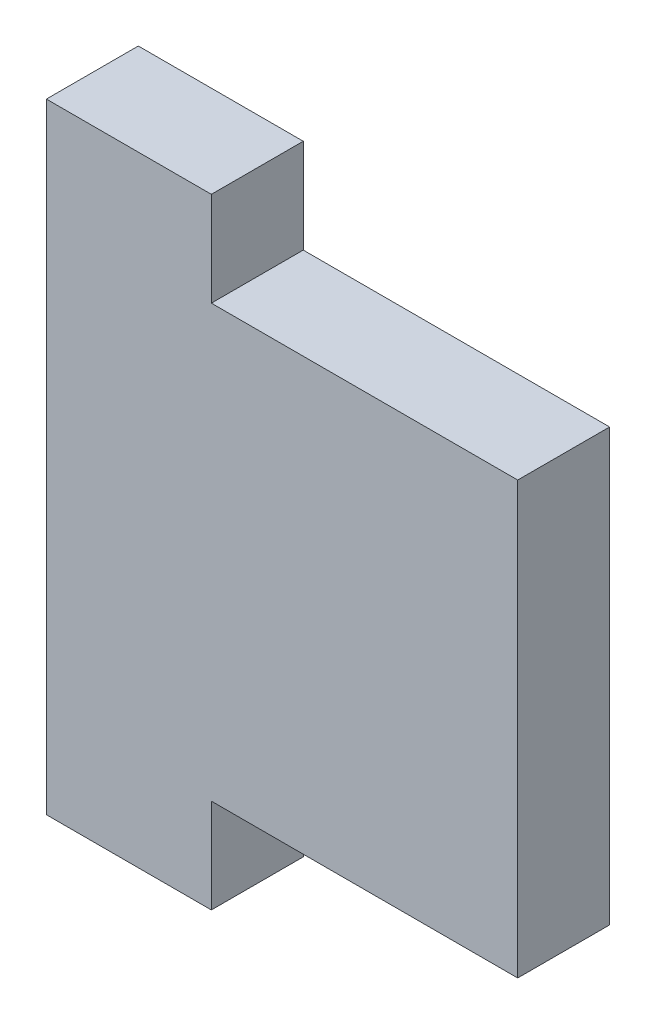
ISO-10303-21;
HEADER;
FILE_DESCRIPTION(('STEP AP214'),'2;1');
FILE_NAME('part.step','',(''),(''),'','','');
FILE_SCHEMA(('AUTOMOTIVE_DESIGN { 1 0 10303 214 1 1 1 1 }'));
ENDSEC;
DATA;
#1=APPLICATION_CONTEXT('core data for automotive mechanical design processes');
#2=APPLICATION_PROTOCOL_DEFINITION('international standard','automotive_design',2000,#1);
#3=PRODUCT_CONTEXT('',#1,'mechanical');
#4=PRODUCT('Part','Part','',(#3));
#5=PRODUCT_RELATED_PRODUCT_CATEGORY('part','',(#4));
#6=PRODUCT_DEFINITION_FORMATION('','',#4);
#7=PRODUCT_DEFINITION_CONTEXT('part definition',#1,'design');
#8=PRODUCT_DEFINITION('design','',#6,#7);
#9=PRODUCT_DEFINITION_SHAPE('','',#8);
#10=(LENGTH_UNIT() NAMED_UNIT(*) SI_UNIT(.MILLI.,.METRE.));
#11=(NAMED_UNIT(*) PLANE_ANGLE_UNIT() SI_UNIT($,.RADIAN.));
#12=(NAMED_UNIT(*) SI_UNIT($,.STERADIAN.) SOLID_ANGLE_UNIT());
#13=UNCERTAINTY_MEASURE_WITH_UNIT(LENGTH_MEASURE(1.E-05),#10,'distance_accuracy_value','');
#14=(GEOMETRIC_REPRESENTATION_CONTEXT(3) GLOBAL_UNCERTAINTY_ASSIGNED_CONTEXT((#13)) GLOBAL_UNIT_ASSIGNED_CONTEXT((#10,
#11,#12)) REPRESENTATION_CONTEXT('',''));
#15=CARTESIAN_POINT('',(0.,0.,0.));
#16=DIRECTION('',(0.,0.,1.));
#17=DIRECTION('',(1.,0.,0.));
#18=AXIS2_PLACEMENT_3D('',#15,#16,#17);
#19=CARTESIAN_POINT('',(-54.483,11.6205,2.4765));
#20=DIRECTION('',(-1.,0.,0.));
#21=DIRECTION('',(0.,0.,1.));
#22=AXIS2_PLACEMENT_3D('',#19,#20,#21);
#23=PLANE('',#22);
#24=DIRECTION('',(0.,1.,0.));
#25=VECTOR('',#24,1.);
#26=CARTESIAN_POINT('',(-54.483,11.6205,-2.4765));
#27=LINE('',#26,#25);
#28=CARTESIAN_POINT('',(-54.483,-11.6205,-2.4765));
#29=VERTEX_POINT('',#28);
#30=CARTESIAN_POINT('',(-54.483,11.6205,-2.4765));
#31=VERTEX_POINT('',#30);
#32=EDGE_CURVE('E129',#29,#31,#27,.T.);
#33=ORIENTED_EDGE('',*,*,#32,.T.);
#34=DIRECTION('',(0.,0.,-1.));
#35=VECTOR('',#34,1.);
#36=CARTESIAN_POINT('',(-54.483,11.6205,2.4765));
#37=LINE('',#36,#35);
#38=CARTESIAN_POINT('',(-54.483,11.6205,2.4765));
#39=VERTEX_POINT('',#38);
#40=EDGE_CURVE('E11',#39,#31,#37,.T.);
#41=ORIENTED_EDGE('',*,*,#40,.F.);
#42=DIRECTION('',(0.,1.,0.));
#43=VECTOR('',#42,1.);
#44=CARTESIAN_POINT('',(-54.483,11.6205,2.4765));
#45=LINE('',#44,#43);
#46=CARTESIAN_POINT('',(-54.483,-11.6205,2.4765));
#47=VERTEX_POINT('',#46);
#48=EDGE_CURVE('E143',#47,#39,#45,.T.);
#49=ORIENTED_EDGE('',*,*,#48,.F.);
#50=DIRECTION('',(0.,0.,-1.));
#51=VECTOR('',#50,1.);
#52=CARTESIAN_POINT('',(-54.483,-11.6205,2.4765));
#53=LINE('',#52,#51);
#54=EDGE_CURVE('E125',#47,#29,#53,.T.);
#55=ORIENTED_EDGE('',*,*,#54,.T.);
#56=EDGE_LOOP('',(#33,#41,#49,#55));
#57=FACE_BOUND('',#56,.T.);
#58=ADVANCED_FACE('F33',(#57),#23,.F.);
#59=CARTESIAN_POINT('',(-54.483,11.6205,2.4765));
#60=DIRECTION('',(0.,-1.,0.));
#61=DIRECTION('',(1.,0.,0.));
#62=AXIS2_PLACEMENT_3D('',#59,#60,#61);
#63=PLANE('',#62);
#64=DIRECTION('',(-1.,0.,0.));
#65=VECTOR('',#64,1.);
#66=CARTESIAN_POINT('',(-54.483,11.6205,-2.4765));
#67=LINE('',#66,#65);
#68=CARTESIAN_POINT('',(-70.993,11.6205,-2.4765));
#69=VERTEX_POINT('',#68);
#70=EDGE_CURVE('E132',#31,#69,#67,.T.);
#71=ORIENTED_EDGE('',*,*,#70,.T.);
#72=DIRECTION('',(0.,0.,-1.));
#73=VECTOR('',#72,1.);
#74=CARTESIAN_POINT('',(-70.993,11.6205,2.4765));
#75=LINE('',#74,#73);
#76=CARTESIAN_POINT('',(-70.993,11.6205,2.4765));
#77=VERTEX_POINT('',#76);
#78=EDGE_CURVE('E41',#77,#69,#75,.T.);
#79=ORIENTED_EDGE('',*,*,#78,.F.);
#80=DIRECTION('',(-1.,0.,0.));
#81=VECTOR('',#80,1.);
#82=CARTESIAN_POINT('',(-54.483,11.6205,2.4765));
#83=LINE('',#82,#81);
#84=EDGE_CURVE('E92',#39,#77,#83,.T.);
#85=ORIENTED_EDGE('',*,*,#84,.F.);
#86=ORIENTED_EDGE('',*,*,#40,.T.);
#87=EDGE_LOOP('',(#71,#79,#85,#86));
#88=FACE_BOUND('',#87,.T.);
#89=ADVANCED_FACE('F178',(#88),#63,.F.);
#90=CARTESIAN_POINT('',(-70.993,16.7005,2.4765));
#91=DIRECTION('',(-1.,0.,0.));
#92=DIRECTION('',(0.,0.,1.));
#93=AXIS2_PLACEMENT_3D('',#90,#91,#92);
#94=PLANE('',#93);
#95=DIRECTION('',(0.,1.,0.));
#96=VECTOR('',#95,1.);
#97=CARTESIAN_POINT('',(-70.993,16.7005,-2.4765));
#98=LINE('',#97,#96);
#99=CARTESIAN_POINT('',(-70.993,16.7005,-2.4765));
#100=VERTEX_POINT('',#99);
#101=EDGE_CURVE('E134',#69,#100,#98,.T.);
#102=ORIENTED_EDGE('',*,*,#101,.T.);
#103=DIRECTION('',(0.,0.,-1.));
#104=VECTOR('',#103,1.);
#105=CARTESIAN_POINT('',(-70.993,16.7005,2.4765));
#106=LINE('',#105,#104);
#107=CARTESIAN_POINT('',(-70.993,16.7005,2.4765));
#108=VERTEX_POINT('',#107);
#109=EDGE_CURVE('E150',#108,#100,#106,.T.);
#110=ORIENTED_EDGE('',*,*,#109,.F.);
#111=DIRECTION('',(0.,1.,0.));
#112=VECTOR('',#111,1.);
#113=CARTESIAN_POINT('',(-70.993,16.7005,2.4765));
#114=LINE('',#113,#112);
#115=EDGE_CURVE('E158',#77,#108,#114,.T.);
#116=ORIENTED_EDGE('',*,*,#115,.F.);
#117=ORIENTED_EDGE('',*,*,#78,.T.);
#118=EDGE_LOOP('',(#102,#110,#116,#117));
#119=FACE_BOUND('',#118,.T.);
#120=ADVANCED_FACE('F156',(#119),#94,.F.);
#121=CARTESIAN_POINT('',(-70.993,16.7005,2.4765));
#122=DIRECTION('',(0.,-1.,0.));
#123=DIRECTION('',(0.,0.,-1.));
#124=AXIS2_PLACEMENT_3D('',#121,#122,#123);
#125=PLANE('',#124);
#126=DIRECTION('',(-1.,0.,0.));
#127=VECTOR('',#126,1.);
#128=CARTESIAN_POINT('',(-70.993,16.7005,-2.4765));
#129=LINE('',#128,#127);
#130=CARTESIAN_POINT('',(-79.883,16.7005,-2.4765));
#131=VERTEX_POINT('',#130);
#132=EDGE_CURVE('E136',#100,#131,#129,.T.);
#133=ORIENTED_EDGE('',*,*,#132,.T.);
#134=DIRECTION('',(0.,0.,-1.));
#135=VECTOR('',#134,1.);
#136=CARTESIAN_POINT('',(-79.883,16.7005,2.4765));
#137=LINE('',#136,#135);
#138=CARTESIAN_POINT('',(-79.883,16.7005,2.4765));
#139=VERTEX_POINT('',#138);
#140=EDGE_CURVE('E147',#139,#131,#137,.T.);
#141=ORIENTED_EDGE('',*,*,#140,.F.);
#142=DIRECTION('',(-1.,0.,0.));
#143=VECTOR('',#142,1.);
#144=CARTESIAN_POINT('',(-70.993,16.7005,2.4765));
#145=LINE('',#144,#143);
#146=EDGE_CURVE('E170',#108,#139,#145,.T.);
#147=ORIENTED_EDGE('',*,*,#146,.F.);
#148=ORIENTED_EDGE('',*,*,#109,.T.);
#149=EDGE_LOOP('',(#133,#141,#147,#148));
#150=FACE_BOUND('',#149,.T.);
#151=ADVANCED_FACE('F166',(#150),#125,.F.);
#152=CARTESIAN_POINT('',(-79.883,16.7005,2.4765));
#153=DIRECTION('',(1.,0.,0.));
#154=DIRECTION('',(0.,0.,-1.));
#155=AXIS2_PLACEMENT_3D('',#152,#153,#154);
#156=PLANE('',#155);
#157=DIRECTION('',(0.,-1.,0.));
#158=VECTOR('',#157,1.);
#159=CARTESIAN_POINT('',(-79.883,16.7005,-2.4765));
#160=LINE('',#159,#158);
#161=CARTESIAN_POINT('',(-79.883,-16.7005,-2.4765));
#162=VERTEX_POINT('',#161);
#163=EDGE_CURVE('E138',#131,#162,#160,.T.);
#164=ORIENTED_EDGE('',*,*,#163,.T.);
#165=DIRECTION('',(0.,0.,-1.));
#166=VECTOR('',#165,1.);
#167=CARTESIAN_POINT('',(-79.883,-16.7005,2.4765));
#168=LINE('',#167,#166);
#169=CARTESIAN_POINT('',(-79.883,-16.7005,2.4765));
#170=VERTEX_POINT('',#169);
#171=EDGE_CURVE('E120',#170,#162,#168,.T.);
#172=ORIENTED_EDGE('',*,*,#171,.F.);
#173=DIRECTION('',(0.,-1.,0.));
#174=VECTOR('',#173,1.);
#175=CARTESIAN_POINT('',(-79.883,16.7005,2.4765));
#176=LINE('',#175,#174);
#177=EDGE_CURVE('E111',#139,#170,#176,.T.);
#178=ORIENTED_EDGE('',*,*,#177,.F.);
#179=ORIENTED_EDGE('',*,*,#140,.T.);
#180=EDGE_LOOP('',(#164,#172,#178,#179));
#181=FACE_BOUND('',#180,.T.);
#182=ADVANCED_FACE('F169',(#181),#156,.F.);
#183=CARTESIAN_POINT('',(-70.993,-16.7005,2.4765));
#184=DIRECTION('',(0.,1.,0.));
#185=DIRECTION('',(0.,0.,1.));
#186=AXIS2_PLACEMENT_3D('',#183,#184,#185);
#187=PLANE('',#186);
#188=DIRECTION('',(1.,0.,0.));
#189=VECTOR('',#188,1.);
#190=CARTESIAN_POINT('',(-70.993,-16.7005,-2.4765));
#191=LINE('',#190,#189);
#192=CARTESIAN_POINT('',(-70.993,-16.7005,-2.4765));
#193=VERTEX_POINT('',#192);
#194=EDGE_CURVE('E119',#162,#193,#191,.T.);
#195=ORIENTED_EDGE('',*,*,#194,.T.);
#196=DIRECTION('',(0.,0.,-1.));
#197=VECTOR('',#196,1.);
#198=CARTESIAN_POINT('',(-70.993,-16.7005,2.4765));
#199=LINE('',#198,#197);
#200=CARTESIAN_POINT('',(-70.993,-16.7005,2.4765));
#201=VERTEX_POINT('',#200);
#202=EDGE_CURVE('E116',#201,#193,#199,.T.);
#203=ORIENTED_EDGE('',*,*,#202,.F.);
#204=DIRECTION('',(1.,0.,0.));
#205=VECTOR('',#204,1.);
#206=CARTESIAN_POINT('',(-70.993,-16.7005,2.4765));
#207=LINE('',#206,#205);
#208=EDGE_CURVE('E105',#170,#201,#207,.T.);
#209=ORIENTED_EDGE('',*,*,#208,.F.);
#210=ORIENTED_EDGE('',*,*,#171,.T.);
#211=EDGE_LOOP('',(#195,#203,#209,#210));
#212=FACE_BOUND('',#211,.T.);
#213=ADVANCED_FACE('F117',(#212),#187,.F.);
#214=CARTESIAN_POINT('',(-70.993,-11.6205,2.4765));
#215=DIRECTION('',(-1.,0.,0.));
#216=DIRECTION('',(0.,0.,1.));
#217=AXIS2_PLACEMENT_3D('',#214,#215,#216);
#218=PLANE('',#217);
#219=DIRECTION('',(0.,1.,0.));
#220=VECTOR('',#219,1.);
#221=CARTESIAN_POINT('',(-70.993,-11.6205,-2.4765));
#222=LINE('',#221,#220);
#223=CARTESIAN_POINT('',(-70.993,-11.6205,-2.4765));
#224=VERTEX_POINT('',#223);
#225=EDGE_CURVE('E78',#193,#224,#222,.T.);
#226=ORIENTED_EDGE('',*,*,#225,.T.);
#227=DIRECTION('',(0.,0.,-1.));
#228=VECTOR('',#227,1.);
#229=CARTESIAN_POINT('',(-70.993,-11.6205,2.4765));
#230=LINE('',#229,#228);
#231=CARTESIAN_POINT('',(-70.993,-11.6205,2.4765));
#232=VERTEX_POINT('',#231);
#233=EDGE_CURVE('E121',#232,#224,#230,.T.);
#234=ORIENTED_EDGE('',*,*,#233,.F.);
#235=DIRECTION('',(0.,1.,0.));
#236=VECTOR('',#235,1.);
#237=CARTESIAN_POINT('',(-70.993,-11.6205,2.4765));
#238=LINE('',#237,#236);
#239=EDGE_CURVE('E109',#201,#232,#238,.T.);
#240=ORIENTED_EDGE('',*,*,#239,.F.);
#241=ORIENTED_EDGE('',*,*,#202,.T.);
#242=EDGE_LOOP('',(#226,#234,#240,#241));
#243=FACE_BOUND('',#242,.T.);
#244=ADVANCED_FACE('F123',(#243),#218,.F.);
#245=CARTESIAN_POINT('',(-54.483,-11.6205,2.4765));
#246=DIRECTION('',(0.,1.,0.));
#247=DIRECTION('',(-1.,0.,0.));
#248=AXIS2_PLACEMENT_3D('',#245,#246,#247);
#249=PLANE('',#248);
#250=DIRECTION('',(1.,0.,0.));
#251=VECTOR('',#250,1.);
#252=CARTESIAN_POINT('',(-54.483,-11.6205,-2.4765));
#253=LINE('',#252,#251);
#254=EDGE_CURVE('E84',#224,#29,#253,.T.);
#255=ORIENTED_EDGE('',*,*,#254,.T.);
#256=ORIENTED_EDGE('',*,*,#54,.F.);
#257=DIRECTION('',(1.,0.,0.));
#258=VECTOR('',#257,1.);
#259=CARTESIAN_POINT('',(-54.483,-11.6205,2.4765));
#260=LINE('',#259,#258);
#261=EDGE_CURVE('E49',#232,#47,#260,.T.);
#262=ORIENTED_EDGE('',*,*,#261,.F.);
#263=ORIENTED_EDGE('',*,*,#233,.T.);
#264=EDGE_LOOP('',(#255,#256,#262,#263));
#265=FACE_BOUND('',#264,.T.);
#266=ADVANCED_FACE('F194',(#265),#249,.F.);
#267=CARTESIAN_POINT('',(0.,0.,2.4765));
#268=DIRECTION('',(0.,0.,-1.));
#269=DIRECTION('',(-1.,0.,0.));
#270=AXIS2_PLACEMENT_3D('',#267,#268,#269);
#271=PLANE('',#270);
#272=ORIENTED_EDGE('',*,*,#48,.T.);
#273=ORIENTED_EDGE('',*,*,#84,.T.);
#274=ORIENTED_EDGE('',*,*,#115,.T.);
#275=ORIENTED_EDGE('',*,*,#146,.T.);
#276=ORIENTED_EDGE('',*,*,#177,.T.);
#277=ORIENTED_EDGE('',*,*,#208,.T.);
#278=ORIENTED_EDGE('',*,*,#239,.T.);
#279=ORIENTED_EDGE('',*,*,#261,.T.);
#280=EDGE_LOOP('',(#272,#273,#274,#275,#276,#277,#278,#279));
#281=FACE_BOUND('',#280,.T.);
#282=ADVANCED_FACE('F107',(#281),#271,.F.);
#283=CARTESIAN_POINT('',(0.,0.,-2.4765));
#284=DIRECTION('',(0.,0.,-1.));
#285=DIRECTION('',(-1.,0.,0.));
#286=AXIS2_PLACEMENT_3D('',#283,#284,#285);
#287=PLANE('',#286);
#288=ORIENTED_EDGE('',*,*,#32,.F.);
#289=ORIENTED_EDGE('',*,*,#254,.F.);
#290=ORIENTED_EDGE('',*,*,#225,.F.);
#291=ORIENTED_EDGE('',*,*,#194,.F.);
#292=ORIENTED_EDGE('',*,*,#163,.F.);
#293=ORIENTED_EDGE('',*,*,#132,.F.);
#294=ORIENTED_EDGE('',*,*,#101,.F.);
#295=ORIENTED_EDGE('',*,*,#70,.F.);
#296=EDGE_LOOP('',(#288,#289,#290,#291,#292,#293,#294,#295));
#297=FACE_BOUND('',#296,.T.);
#298=ADVANCED_FACE('F162',(#297),#287,.T.);
#299=CLOSED_SHELL('',(#58,#89,#120,#151,#182,#213,#244,#266,#282,#298));
#300=MANIFOLD_SOLID_BREP('B2',#299);
#301=ADVANCED_BREP_SHAPE_REPRESENTATION('',(#18,#300),#14);
#302=SHAPE_DEFINITION_REPRESENTATION(#9,#301);
ENDSEC;
END-ISO-10303-21;
